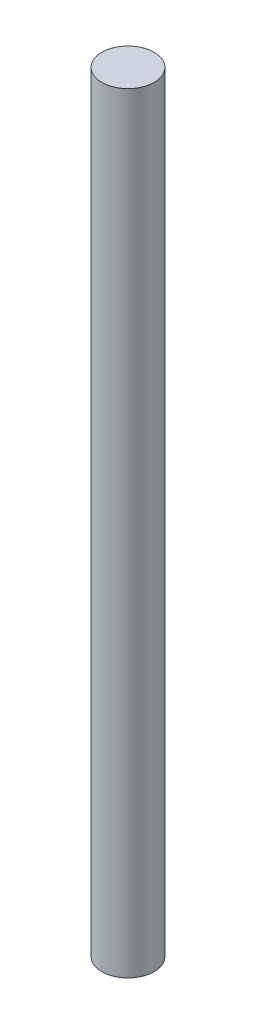
ISO-10303-21;
HEADER;
FILE_DESCRIPTION(('STEP AP214'),'2;1');
FILE_NAME('part.step','',(''),(''),'','','');
FILE_SCHEMA(('AUTOMOTIVE_DESIGN { 1 0 10303 214 1 1 1 1 }'));
ENDSEC;
DATA;
#1=APPLICATION_CONTEXT('core data for automotive mechanical design processes');
#2=APPLICATION_PROTOCOL_DEFINITION('international standard','automotive_design',2000,#1);
#3=PRODUCT_CONTEXT('',#1,'mechanical');
#4=PRODUCT('Part','Part','',(#3));
#5=PRODUCT_RELATED_PRODUCT_CATEGORY('part','',(#4));
#6=PRODUCT_DEFINITION_FORMATION('','',#4);
#7=PRODUCT_DEFINITION_CONTEXT('part definition',#1,'design');
#8=PRODUCT_DEFINITION('design','',#6,#7);
#9=PRODUCT_DEFINITION_SHAPE('','',#8);
#10=(LENGTH_UNIT() NAMED_UNIT(*) SI_UNIT(.MILLI.,.METRE.));
#11=(NAMED_UNIT(*) PLANE_ANGLE_UNIT() SI_UNIT($,.RADIAN.));
#12=(NAMED_UNIT(*) SI_UNIT($,.STERADIAN.) SOLID_ANGLE_UNIT());
#13=UNCERTAINTY_MEASURE_WITH_UNIT(LENGTH_MEASURE(1.E-05),#10,'distance_accuracy_value','');
#14=(GEOMETRIC_REPRESENTATION_CONTEXT(3) GLOBAL_UNCERTAINTY_ASSIGNED_CONTEXT((#13)) GLOBAL_UNIT_ASSIGNED_CONTEXT((#10,
#11,#12)) REPRESENTATION_CONTEXT('',''));
#15=CARTESIAN_POINT('',(0.,0.,0.));
#16=DIRECTION('',(0.,0.,1.));
#17=DIRECTION('',(1.,0.,0.));
#18=AXIS2_PLACEMENT_3D('',#15,#16,#17);
#19=CARTESIAN_POINT('',(0.,59.,0.));
#20=DIRECTION('',(0.,-1.,0.));
#21=DIRECTION('',(0.,0.,-1.));
#22=AXIS2_PLACEMENT_3D('',#19,#20,#21);
#23=CYLINDRICAL_SURFACE('',#22,2.);
#24=CARTESIAN_POINT('',(0.,59.,0.));
#25=DIRECTION('',(0.,1.,0.));
#26=DIRECTION('',(0.,0.,1.));
#27=AXIS2_PLACEMENT_3D('',#24,#25,#26);
#28=CIRCLE('',#27,2.);
#29=CARTESIAN_POINT('',(0.,59.,2.));
#30=VERTEX_POINT('',#29);
#31=EDGE_CURVE('E10',#30,#30,#28,.T.);
#32=ORIENTED_EDGE('',*,*,#31,.F.);
#33=EDGE_LOOP('',(#32));
#34=FACE_BOUND('',#33,.T.);
#35=CARTESIAN_POINT('',(0.,0.,0.));
#36=DIRECTION('',(0.,1.,0.));
#37=DIRECTION('',(0.,0.,1.));
#38=AXIS2_PLACEMENT_3D('',#35,#36,#37);
#39=CIRCLE('',#38,2.);
#40=CARTESIAN_POINT('',(0.,0.,2.));
#41=VERTEX_POINT('',#40);
#42=EDGE_CURVE('E40',#41,#41,#39,.T.);
#43=ORIENTED_EDGE('',*,*,#42,.T.);
#44=EDGE_LOOP('',(#43));
#45=FACE_BOUND('',#44,.T.);
#46=ADVANCED_FACE('F37',(#34,#45),#23,.T.);
#47=CARTESIAN_POINT('',(0.,59.,0.));
#48=DIRECTION('',(0.,1.,0.));
#49=DIRECTION('',(0.,0.,1.));
#50=AXIS2_PLACEMENT_3D('',#47,#48,#49);
#51=PLANE('',#50);
#52=ORIENTED_EDGE('',*,*,#31,.T.);
#53=EDGE_LOOP('',(#52));
#54=FACE_BOUND('',#53,.T.);
#55=ADVANCED_FACE('F52',(#54),#51,.T.);
#56=CARTESIAN_POINT('',(0.,0.,0.));
#57=DIRECTION('',(0.,1.,0.));
#58=DIRECTION('',(0.,0.,1.));
#59=AXIS2_PLACEMENT_3D('',#56,#57,#58);
#60=PLANE('',#59);
#61=ORIENTED_EDGE('',*,*,#42,.F.);
#62=EDGE_LOOP('',(#61));
#63=FACE_BOUND('',#62,.T.);
#64=ADVANCED_FACE('F50',(#63),#60,.F.);
#65=CLOSED_SHELL('',(#46,#55,#64));
#66=MANIFOLD_SOLID_BREP('B2',#65);
#67=ADVANCED_BREP_SHAPE_REPRESENTATION('',(#18,#66),#14);
#68=SHAPE_DEFINITION_REPRESENTATION(#9,#67);
ENDSEC;
END-ISO-10303-21;
